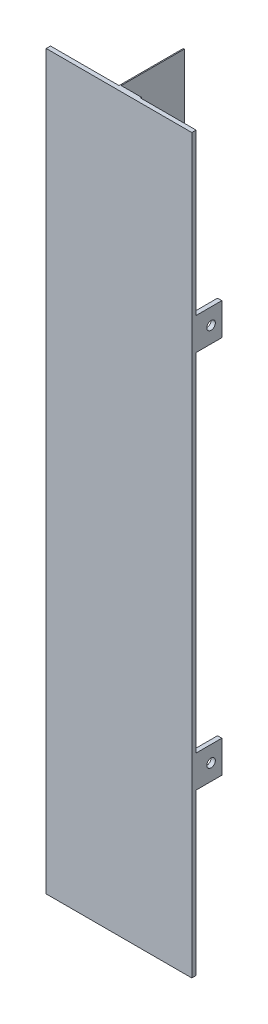
ISO-10303-21;
HEADER;
FILE_DESCRIPTION(('STEP AP214'),'2;1');
FILE_NAME('part.step','',(''),(''),'','','');
FILE_SCHEMA(('AUTOMOTIVE_DESIGN { 1 0 10303 214 1 1 1 1 }'));
ENDSEC;
DATA;
#1=APPLICATION_CONTEXT('core data for automotive mechanical design processes');
#2=APPLICATION_PROTOCOL_DEFINITION('international standard','automotive_design',2000,#1);
#3=PRODUCT_CONTEXT('',#1,'mechanical');
#4=PRODUCT('Part','Part','',(#3));
#5=PRODUCT_RELATED_PRODUCT_CATEGORY('part','',(#4));
#6=PRODUCT_DEFINITION_FORMATION('','',#4);
#7=PRODUCT_DEFINITION_CONTEXT('part definition',#1,'design');
#8=PRODUCT_DEFINITION('design','',#6,#7);
#9=PRODUCT_DEFINITION_SHAPE('','',#8);
#10=(LENGTH_UNIT() NAMED_UNIT(*) SI_UNIT(.MILLI.,.METRE.));
#11=(NAMED_UNIT(*) PLANE_ANGLE_UNIT() SI_UNIT($,.RADIAN.));
#12=(NAMED_UNIT(*) SI_UNIT($,.STERADIAN.) SOLID_ANGLE_UNIT());
#13=UNCERTAINTY_MEASURE_WITH_UNIT(LENGTH_MEASURE(1.E-05),#10,'distance_accuracy_value','');
#14=(GEOMETRIC_REPRESENTATION_CONTEXT(3) GLOBAL_UNCERTAINTY_ASSIGNED_CONTEXT((#13)) GLOBAL_UNIT_ASSIGNED_CONTEXT((#10,
#11,#12)) REPRESENTATION_CONTEXT('',''));
#15=CARTESIAN_POINT('',(0.,0.,0.));
#16=DIRECTION('',(0.,0.,1.));
#17=DIRECTION('',(1.,0.,0.));
#18=AXIS2_PLACEMENT_3D('',#15,#16,#17);
#19=CARTESIAN_POINT('',(0.,342.,-2.));
#20=DIRECTION('',(0.,0.,1.));
#21=DIRECTION('',(1.,0.,0.));
#22=AXIS2_PLACEMENT_3D('',#19,#20,#21);
#23=PLANE('',#22);
#24=DIRECTION('',(1.,0.,0.));
#25=VECTOR('',#24,1.);
#26=CARTESIAN_POINT('',(0.,267.,-2.));
#27=LINE('',#26,#25);
#28=CARTESIAN_POINT('',(0.,267.,-2.));
#29=VERTEX_POINT('',#28);
#30=CARTESIAN_POINT('',(2.,267.,-2.));
#31=VERTEX_POINT('',#30);
#32=EDGE_CURVE('E400',#29,#31,#27,.T.);
#33=ORIENTED_EDGE('',*,*,#32,.F.);
#34=DIRECTION('',(0.,-1.,0.));
#35=VECTOR('',#34,1.);
#36=CARTESIAN_POINT('',(0.,342.,-2.));
#37=LINE('',#36,#35);
#38=CARTESIAN_POINT('',(0.,342.,-2.));
#39=VERTEX_POINT('',#38);
#40=EDGE_CURVE('E232',#39,#29,#37,.T.);
#41=ORIENTED_EDGE('',*,*,#40,.F.);
#42=DIRECTION('',(-1.,0.,0.));
#43=VECTOR('',#42,1.);
#44=CARTESIAN_POINT('',(0.,342.,-2.));
#45=LINE('',#44,#43);
#46=CARTESIAN_POINT('',(32.,342.,-2.));
#47=VERTEX_POINT('',#46);
#48=EDGE_CURVE('E342',#47,#39,#45,.T.);
#49=ORIENTED_EDGE('',*,*,#48,.F.);
#50=DIRECTION('',(0.,-1.,0.));
#51=VECTOR('',#50,1.);
#52=CARTESIAN_POINT('',(32.,342.,-2.));
#53=LINE('',#52,#51);
#54=CARTESIAN_POINT('',(32.,0.,-2.));
#55=VERTEX_POINT('',#54);
#56=EDGE_CURVE('E372',#47,#55,#53,.T.);
#57=ORIENTED_EDGE('',*,*,#56,.T.);
#58=DIRECTION('',(-1.,0.,0.));
#59=VECTOR('',#58,1.);
#60=CARTESIAN_POINT('',(0.,0.,-2.));
#61=LINE('',#60,#59);
#62=CARTESIAN_POINT('',(0.,0.,-2.));
#63=VERTEX_POINT('',#62);
#64=EDGE_CURVE('E364',#55,#63,#61,.T.);
#65=ORIENTED_EDGE('',*,*,#64,.T.);
#66=CARTESIAN_POINT('',(0.,75.,-2.));
#67=VERTEX_POINT('',#66);
#68=EDGE_CURVE('E370',#67,#63,#37,.T.);
#69=ORIENTED_EDGE('',*,*,#68,.F.);
#70=DIRECTION('',(-1.,0.,0.));
#71=VECTOR('',#70,1.);
#72=CARTESIAN_POINT('',(0.,75.,-2.));
#73=LINE('',#72,#71);
#74=CARTESIAN_POINT('',(2.,75.,-2.));
#75=VERTEX_POINT('',#74);
#76=EDGE_CURVE('E245',#75,#67,#73,.T.);
#77=ORIENTED_EDGE('',*,*,#76,.F.);
#78=DIRECTION('',(0.,-1.,0.));
#79=VECTOR('',#78,1.);
#80=CARTESIAN_POINT('',(2.,75.,-2.));
#81=LINE('',#80,#79);
#82=CARTESIAN_POINT('',(2.,90.,-2.));
#83=VERTEX_POINT('',#82);
#84=EDGE_CURVE('E235',#83,#75,#81,.T.);
#85=ORIENTED_EDGE('',*,*,#84,.F.);
#86=DIRECTION('',(1.,0.,0.));
#87=VECTOR('',#86,1.);
#88=CARTESIAN_POINT('',(0.,90.,-2.));
#89=LINE('',#88,#87);
#90=CARTESIAN_POINT('',(0.,90.,-2.));
#91=VERTEX_POINT('',#90);
#92=EDGE_CURVE('E233',#91,#83,#89,.T.);
#93=ORIENTED_EDGE('',*,*,#92,.F.);
#94=CARTESIAN_POINT('',(0.,252.,-2.));
#95=VERTEX_POINT('',#94);
#96=EDGE_CURVE('E373',#95,#91,#37,.T.);
#97=ORIENTED_EDGE('',*,*,#96,.F.);
#98=DIRECTION('',(-1.,0.,0.));
#99=VECTOR('',#98,1.);
#100=CARTESIAN_POINT('',(0.,252.,-2.));
#101=LINE('',#100,#99);
#102=CARTESIAN_POINT('',(2.,252.,-2.));
#103=VERTEX_POINT('',#102);
#104=EDGE_CURVE('E226',#103,#95,#101,.T.);
#105=ORIENTED_EDGE('',*,*,#104,.F.);
#106=DIRECTION('',(0.,-1.,0.));
#107=VECTOR('',#106,1.);
#108=CARTESIAN_POINT('',(2.,252.,-2.));
#109=LINE('',#108,#107);
#110=EDGE_CURVE('E423',#31,#103,#109,.T.);
#111=ORIENTED_EDGE('',*,*,#110,.F.);
#112=EDGE_LOOP('',(#33,#41,#49,#57,#65,#69,#77,#85,#93,#97,#105,#111));
#113=FACE_BOUND('',#112,.T.);
#114=ADVANCED_FACE('F35',(#113),#23,.F.);
#115=CARTESIAN_POINT('',(42.,342.,-2.));
#116=DIRECTION('',(0.,0.,1.));
#117=DIRECTION('',(1.,0.,0.));
#118=AXIS2_PLACEMENT_3D('',#115,#116,#117);
#119=PLANE('',#118);
#120=DIRECTION('',(-1.,0.,0.));
#121=VECTOR('',#120,1.);
#122=CARTESIAN_POINT('',(68.,252.,-2.00000000000001));
#123=LINE('',#122,#121);
#124=CARTESIAN_POINT('',(68.,252.,-2.00000000000001));
#125=VERTEX_POINT('',#124);
#126=CARTESIAN_POINT('',(66.,252.,-2.));
#127=VERTEX_POINT('',#126);
#128=EDGE_CURVE('E263',#125,#127,#123,.T.);
#129=ORIENTED_EDGE('',*,*,#128,.F.);
#130=DIRECTION('',(0.,-1.,0.));
#131=VECTOR('',#130,1.);
#132=CARTESIAN_POINT('',(68.,342.,-2.));
#133=LINE('',#132,#131);
#134=CARTESIAN_POINT('',(68.,90.,-2.00000000000001));
#135=VERTEX_POINT('',#134);
#136=EDGE_CURVE('E392',#125,#135,#133,.T.);
#137=ORIENTED_EDGE('',*,*,#136,.T.);
#138=DIRECTION('',(1.,0.,0.));
#139=VECTOR('',#138,1.);
#140=CARTESIAN_POINT('',(68.,90.,-2.00000000000001));
#141=LINE('',#140,#139);
#142=CARTESIAN_POINT('',(66.,90.,-2.));
#143=VERTEX_POINT('',#142);
#144=EDGE_CURVE('E298',#143,#135,#141,.T.);
#145=ORIENTED_EDGE('',*,*,#144,.F.);
#146=DIRECTION('',(0.,1.,0.));
#147=VECTOR('',#146,1.);
#148=CARTESIAN_POINT('',(66.,75.,-2.00000000000001));
#149=LINE('',#148,#147);
#150=CARTESIAN_POINT('',(66.,75.,-2.));
#151=VERTEX_POINT('',#150);
#152=EDGE_CURVE('E307',#151,#143,#149,.T.);
#153=ORIENTED_EDGE('',*,*,#152,.F.);
#154=DIRECTION('',(-1.,0.,0.));
#155=VECTOR('',#154,1.);
#156=CARTESIAN_POINT('',(68.,75.,-2.00000000000001));
#157=LINE('',#156,#155);
#158=CARTESIAN_POINT('',(68.,75.,-2.));
#159=VERTEX_POINT('',#158);
#160=EDGE_CURVE('E293',#159,#151,#157,.T.);
#161=ORIENTED_EDGE('',*,*,#160,.F.);
#162=CARTESIAN_POINT('',(68.,0.,-2.));
#163=VERTEX_POINT('',#162);
#164=EDGE_CURVE('E391',#159,#163,#133,.T.);
#165=ORIENTED_EDGE('',*,*,#164,.T.);
#166=DIRECTION('',(-1.,0.,0.));
#167=VECTOR('',#166,1.);
#168=CARTESIAN_POINT('',(42.,0.,-2.));
#169=LINE('',#168,#167);
#170=CARTESIAN_POINT('',(42.,0.,-2.));
#171=VERTEX_POINT('',#170);
#172=EDGE_CURVE('E352',#163,#171,#169,.T.);
#173=ORIENTED_EDGE('',*,*,#172,.T.);
#174=DIRECTION('',(0.,-1.,0.));
#175=VECTOR('',#174,1.);
#176=CARTESIAN_POINT('',(42.,342.,-2.));
#177=LINE('',#176,#175);
#178=CARTESIAN_POINT('',(42.,342.,-2.));
#179=VERTEX_POINT('',#178);
#180=EDGE_CURVE('E388',#179,#171,#177,.T.);
#181=ORIENTED_EDGE('',*,*,#180,.F.);
#182=DIRECTION('',(-1.,0.,0.));
#183=VECTOR('',#182,1.);
#184=CARTESIAN_POINT('',(42.,342.,-2.));
#185=LINE('',#184,#183);
#186=CARTESIAN_POINT('',(68.,342.,-2.));
#187=VERTEX_POINT('',#186);
#188=EDGE_CURVE('E330',#187,#179,#185,.T.);
#189=ORIENTED_EDGE('',*,*,#188,.F.);
#190=CARTESIAN_POINT('',(68.,267.,-2.));
#191=VERTEX_POINT('',#190);
#192=EDGE_CURVE('E44',#187,#191,#133,.T.);
#193=ORIENTED_EDGE('',*,*,#192,.T.);
#194=DIRECTION('',(1.,0.,0.));
#195=VECTOR('',#194,1.);
#196=CARTESIAN_POINT('',(68.,267.,-2.00000000000001));
#197=LINE('',#196,#195);
#198=CARTESIAN_POINT('',(66.,267.,-2.));
#199=VERTEX_POINT('',#198);
#200=EDGE_CURVE('E268',#199,#191,#197,.T.);
#201=ORIENTED_EDGE('',*,*,#200,.F.);
#202=DIRECTION('',(0.,1.,0.));
#203=VECTOR('',#202,1.);
#204=CARTESIAN_POINT('',(66.,252.,-2.00000000000001));
#205=LINE('',#204,#203);
#206=EDGE_CURVE('E277',#127,#199,#205,.T.);
#207=ORIENTED_EDGE('',*,*,#206,.F.);
#208=EDGE_LOOP('',(#129,#137,#145,#153,#161,#165,#173,#181,#189,#193,#201,#207));
#209=FACE_BOUND('',#208,.T.);
#210=ADVANCED_FACE('F468',(#209),#119,.F.);
#211=CARTESIAN_POINT('',(68.,342.,0.));
#212=DIRECTION('',(0.,0.,-1.));
#213=DIRECTION('',(-1.,0.,0.));
#214=AXIS2_PLACEMENT_3D('',#211,#212,#213);
#215=PLANE('',#214);
#216=DIRECTION('',(1.,0.,0.));
#217=VECTOR('',#216,1.);
#218=CARTESIAN_POINT('',(68.,0.,0.));
#219=LINE('',#218,#217);
#220=CARTESIAN_POINT('',(0.,0.,0.));
#221=VERTEX_POINT('',#220);
#222=CARTESIAN_POINT('',(68.,0.,0.));
#223=VERTEX_POINT('',#222);
#224=EDGE_CURVE('E323',#221,#223,#219,.T.);
#225=ORIENTED_EDGE('',*,*,#224,.T.);
#226=DIRECTION('',(0.,-1.,0.));
#227=VECTOR('',#226,1.);
#228=CARTESIAN_POINT('',(68.,342.,0.));
#229=LINE('',#228,#227);
#230=CARTESIAN_POINT('',(68.,342.,0.));
#231=VERTEX_POINT('',#230);
#232=EDGE_CURVE('E11',#231,#223,#229,.T.);
#233=ORIENTED_EDGE('',*,*,#232,.F.);
#234=DIRECTION('',(1.,0.,0.));
#235=VECTOR('',#234,1.);
#236=CARTESIAN_POINT('',(68.,342.,0.));
#237=LINE('',#236,#235);
#238=CARTESIAN_POINT('',(0.,342.,0.));
#239=VERTEX_POINT('',#238);
#240=EDGE_CURVE('E324',#239,#231,#237,.T.);
#241=ORIENTED_EDGE('',*,*,#240,.F.);
#242=DIRECTION('',(0.,-1.,0.));
#243=VECTOR('',#242,1.);
#244=CARTESIAN_POINT('',(0.,342.,0.));
#245=LINE('',#244,#243);
#246=EDGE_CURVE('E346',#239,#221,#245,.T.);
#247=ORIENTED_EDGE('',*,*,#246,.T.);
#248=EDGE_LOOP('',(#225,#233,#241,#247));
#249=FACE_BOUND('',#248,.T.);
#250=ADVANCED_FACE('F37',(#249),#215,.F.);
#251=CARTESIAN_POINT('',(68.,342.,-2.));
#252=DIRECTION('',(-1.,0.,0.));
#253=DIRECTION('',(0.,0.,1.));
#254=AXIS2_PLACEMENT_3D('',#251,#252,#253);
#255=PLANE('',#254);
#256=CARTESIAN_POINT('',(68.,259.5,-9.));
#257=DIRECTION('',(1.,0.,0.));
#258=DIRECTION('',(0.,0.,-1.));
#259=AXIS2_PLACEMENT_3D('',#256,#257,#258);
#260=CIRCLE('',#259,2.);
#261=CARTESIAN_POINT('',(68.,259.5,-11.));
#262=VERTEX_POINT('',#261);
#263=EDGE_CURVE('E403',#262,#262,#260,.T.);
#264=ORIENTED_EDGE('',*,*,#263,.F.);
#265=EDGE_LOOP('',(#264));
#266=FACE_BOUND('',#265,.T.);
#267=CARTESIAN_POINT('',(68.,82.5,-9.));
#268=DIRECTION('',(1.,0.,0.));
#269=DIRECTION('',(0.,0.,-1.));
#270=AXIS2_PLACEMENT_3D('',#267,#268,#269);
#271=CIRCLE('',#270,2.);
#272=CARTESIAN_POINT('',(68.,82.5,-11.));
#273=VERTEX_POINT('',#272);
#274=EDGE_CURVE('E409',#273,#273,#271,.T.);
#275=ORIENTED_EDGE('',*,*,#274,.F.);
#276=EDGE_LOOP('',(#275));
#277=FACE_BOUND('',#276,.T.);
#278=DIRECTION('',(0.,0.,-1.));
#279=VECTOR('',#278,1.);
#280=CARTESIAN_POINT('',(68.,0.,-2.));
#281=LINE('',#280,#279);
#282=EDGE_CURVE('E349',#223,#163,#281,.T.);
#283=ORIENTED_EDGE('',*,*,#282,.T.);
#284=ORIENTED_EDGE('',*,*,#164,.F.);
#285=DIRECTION('',(0.,0.,1.));
#286=VECTOR('',#285,1.);
#287=CARTESIAN_POINT('',(68.,75.,-14.));
#288=LINE('',#287,#286);
#289=CARTESIAN_POINT('',(68.,75.,-14.));
#290=VERTEX_POINT('',#289);
#291=EDGE_CURVE('E320',#290,#159,#288,.T.);
#292=ORIENTED_EDGE('',*,*,#291,.F.);
#293=DIRECTION('',(0.,-1.,0.));
#294=VECTOR('',#293,1.);
#295=CARTESIAN_POINT('',(68.,75.,-14.));
#296=LINE('',#295,#294);
#297=CARTESIAN_POINT('',(68.,90.,-14.));
#298=VERTEX_POINT('',#297);
#299=EDGE_CURVE('E294',#298,#290,#296,.T.);
#300=ORIENTED_EDGE('',*,*,#299,.F.);
#301=DIRECTION('',(0.,0.,1.));
#302=VECTOR('',#301,1.);
#303=CARTESIAN_POINT('',(68.,90.,-14.));
#304=LINE('',#303,#302);
#305=EDGE_CURVE('E304',#298,#135,#304,.T.);
#306=ORIENTED_EDGE('',*,*,#305,.T.);
#307=ORIENTED_EDGE('',*,*,#136,.F.);
#308=DIRECTION('',(0.,0.,1.));
#309=VECTOR('',#308,1.);
#310=CARTESIAN_POINT('',(68.,252.,-14.));
#311=LINE('',#310,#309);
#312=CARTESIAN_POINT('',(68.,252.,-14.));
#313=VERTEX_POINT('',#312);
#314=EDGE_CURVE('E290',#313,#125,#311,.T.);
#315=ORIENTED_EDGE('',*,*,#314,.F.);
#316=DIRECTION('',(0.,-1.,0.));
#317=VECTOR('',#316,1.);
#318=CARTESIAN_POINT('',(68.,252.,-14.));
#319=LINE('',#318,#317);
#320=CARTESIAN_POINT('',(68.,267.,-14.));
#321=VERTEX_POINT('',#320);
#322=EDGE_CURVE('E264',#321,#313,#319,.T.);
#323=ORIENTED_EDGE('',*,*,#322,.F.);
#324=DIRECTION('',(0.,0.,1.));
#325=VECTOR('',#324,1.);
#326=CARTESIAN_POINT('',(68.,267.,-14.));
#327=LINE('',#326,#325);
#328=EDGE_CURVE('E274',#321,#191,#327,.T.);
#329=ORIENTED_EDGE('',*,*,#328,.T.);
#330=ORIENTED_EDGE('',*,*,#192,.F.);
#331=DIRECTION('',(0.,0.,-1.));
#332=VECTOR('',#331,1.);
#333=CARTESIAN_POINT('',(68.,342.,-2.));
#334=LINE('',#333,#332);
#335=EDGE_CURVE('E327',#231,#187,#334,.T.);
#336=ORIENTED_EDGE('',*,*,#335,.F.);
#337=ORIENTED_EDGE('',*,*,#232,.T.);
#338=EDGE_LOOP('',(#283,#284,#292,#300,#306,#307,#315,#323,#329,#330,#336,#337));
#339=FACE_BOUND('',#338,.T.);
#340=ADVANCED_FACE('F496',(#266,#277,#339),#255,.F.);
#341=CARTESIAN_POINT('',(42.,342.,-2.5));
#342=DIRECTION('',(-1.,0.,0.));
#343=DIRECTION('',(0.,0.,1.));
#344=AXIS2_PLACEMENT_3D('',#341,#342,#343);
#345=PLANE('',#344);
#346=DIRECTION('',(0.,0.,-1.));
#347=VECTOR('',#346,1.);
#348=CARTESIAN_POINT('',(42.,0.,-2.5));
#349=LINE('',#348,#347);
#350=CARTESIAN_POINT('',(42.,0.,-2.5));
#351=VERTEX_POINT('',#350);
#352=EDGE_CURVE('E354',#171,#351,#349,.T.);
#353=ORIENTED_EDGE('',*,*,#352,.T.);
#354=DIRECTION('',(0.,-1.,0.));
#355=VECTOR('',#354,1.);
#356=CARTESIAN_POINT('',(42.,342.,-2.5));
#357=LINE('',#356,#355);
#358=CARTESIAN_POINT('',(42.,342.,-2.5));
#359=VERTEX_POINT('',#358);
#360=EDGE_CURVE('E385',#359,#351,#357,.T.);
#361=ORIENTED_EDGE('',*,*,#360,.F.);
#362=DIRECTION('',(0.,0.,-1.));
#363=VECTOR('',#362,1.);
#364=CARTESIAN_POINT('',(42.,342.,-2.5));
#365=LINE('',#364,#363);
#366=EDGE_CURVE('E332',#179,#359,#365,.T.);
#367=ORIENTED_EDGE('',*,*,#366,.F.);
#368=ORIENTED_EDGE('',*,*,#180,.T.);
#369=EDGE_LOOP('',(#353,#361,#367,#368));
#370=FACE_BOUND('',#369,.T.);
#371=ADVANCED_FACE('F493',(#370),#345,.F.);
#372=CARTESIAN_POINT('',(32.5,342.,-2.5));
#373=DIRECTION('',(0.,0.,1.));
#374=DIRECTION('',(1.,0.,0.));
#375=AXIS2_PLACEMENT_3D('',#372,#373,#374);
#376=PLANE('',#375);
#377=DIRECTION('',(-1.,0.,0.));
#378=VECTOR('',#377,1.);
#379=CARTESIAN_POINT('',(32.5,0.,-2.5));
#380=LINE('',#379,#378);
#381=CARTESIAN_POINT('',(32.5,0.,-2.5));
#382=VERTEX_POINT('',#381);
#383=EDGE_CURVE('E356',#351,#382,#380,.T.);
#384=ORIENTED_EDGE('',*,*,#383,.T.);
#385=DIRECTION('',(0.,-1.,0.));
#386=VECTOR('',#385,1.);
#387=CARTESIAN_POINT('',(32.5,342.,-2.5));
#388=LINE('',#387,#386);
#389=CARTESIAN_POINT('',(32.5,342.,-2.5));
#390=VERTEX_POINT('',#389);
#391=EDGE_CURVE('E382',#390,#382,#388,.T.);
#392=ORIENTED_EDGE('',*,*,#391,.F.);
#393=DIRECTION('',(-1.,0.,0.));
#394=VECTOR('',#393,1.);
#395=CARTESIAN_POINT('',(32.5,342.,-2.5));
#396=LINE('',#395,#394);
#397=EDGE_CURVE('E334',#359,#390,#396,.T.);
#398=ORIENTED_EDGE('',*,*,#397,.F.);
#399=ORIENTED_EDGE('',*,*,#360,.T.);
#400=EDGE_LOOP('',(#384,#392,#398,#399));
#401=FACE_BOUND('',#400,.T.);
#402=ADVANCED_FACE('F489',(#401),#376,.F.);
#403=CARTESIAN_POINT('',(32.5,342.,-32.));
#404=DIRECTION('',(-1.,0.,0.));
#405=DIRECTION('',(0.,0.,1.));
#406=AXIS2_PLACEMENT_3D('',#403,#404,#405);
#407=PLANE('',#406);
#408=DIRECTION('',(0.,0.,-1.));
#409=VECTOR('',#408,1.);
#410=CARTESIAN_POINT('',(32.5,0.,-32.));
#411=LINE('',#410,#409);
#412=CARTESIAN_POINT('',(32.5,0.,-32.));
#413=VERTEX_POINT('',#412);
#414=EDGE_CURVE('E358',#382,#413,#411,.T.);
#415=ORIENTED_EDGE('',*,*,#414,.T.);
#416=DIRECTION('',(0.,-1.,0.));
#417=VECTOR('',#416,1.);
#418=CARTESIAN_POINT('',(32.5,342.,-32.));
#419=LINE('',#418,#417);
#420=CARTESIAN_POINT('',(32.5,342.,-32.));
#421=VERTEX_POINT('',#420);
#422=EDGE_CURVE('E379',#421,#413,#419,.T.);
#423=ORIENTED_EDGE('',*,*,#422,.F.);
#424=DIRECTION('',(0.,0.,-1.));
#425=VECTOR('',#424,1.);
#426=CARTESIAN_POINT('',(32.5,342.,-32.));
#427=LINE('',#426,#425);
#428=EDGE_CURVE('E336',#390,#421,#427,.T.);
#429=ORIENTED_EDGE('',*,*,#428,.F.);
#430=ORIENTED_EDGE('',*,*,#391,.T.);
#431=EDGE_LOOP('',(#415,#423,#429,#430));
#432=FACE_BOUND('',#431,.T.);
#433=ADVANCED_FACE('F485',(#432),#407,.F.);
#434=CARTESIAN_POINT('',(32.,342.,-32.));
#435=DIRECTION('',(0.,0.,1.));
#436=DIRECTION('',(1.,0.,0.));
#437=AXIS2_PLACEMENT_3D('',#434,#435,#436);
#438=PLANE('',#437);
#439=DIRECTION('',(-1.,0.,0.));
#440=VECTOR('',#439,1.);
#441=CARTESIAN_POINT('',(32.,0.,-32.));
#442=LINE('',#441,#440);
#443=CARTESIAN_POINT('',(32.,0.,-32.));
#444=VERTEX_POINT('',#443);
#445=EDGE_CURVE('E360',#413,#444,#442,.T.);
#446=ORIENTED_EDGE('',*,*,#445,.T.);
#447=DIRECTION('',(0.,-1.,0.));
#448=VECTOR('',#447,1.);
#449=CARTESIAN_POINT('',(32.,342.,-32.));
#450=LINE('',#449,#448);
#451=CARTESIAN_POINT('',(32.,342.,-32.));
#452=VERTEX_POINT('',#451);
#453=EDGE_CURVE('E376',#452,#444,#450,.T.);
#454=ORIENTED_EDGE('',*,*,#453,.F.);
#455=DIRECTION('',(-1.,0.,0.));
#456=VECTOR('',#455,1.);
#457=CARTESIAN_POINT('',(32.,342.,-32.));
#458=LINE('',#457,#456);
#459=EDGE_CURVE('E338',#421,#452,#458,.T.);
#460=ORIENTED_EDGE('',*,*,#459,.F.);
#461=ORIENTED_EDGE('',*,*,#422,.T.);
#462=EDGE_LOOP('',(#446,#454,#460,#461));
#463=FACE_BOUND('',#462,.T.);
#464=ADVANCED_FACE('F481',(#463),#438,.F.);
#465=CARTESIAN_POINT('',(32.,342.,-2.));
#466=DIRECTION('',(1.,0.,0.));
#467=DIRECTION('',(0.,0.,-1.));
#468=AXIS2_PLACEMENT_3D('',#465,#466,#467);
#469=PLANE('',#468);
#470=DIRECTION('',(0.,0.,1.));
#471=VECTOR('',#470,1.);
#472=CARTESIAN_POINT('',(32.,0.,-2.));
#473=LINE('',#472,#471);
#474=EDGE_CURVE('E362',#444,#55,#473,.T.);
#475=ORIENTED_EDGE('',*,*,#474,.T.);
#476=ORIENTED_EDGE('',*,*,#56,.F.);
#477=DIRECTION('',(0.,0.,1.));
#478=VECTOR('',#477,1.);
#479=CARTESIAN_POINT('',(32.,342.,-2.));
#480=LINE('',#479,#478);
#481=EDGE_CURVE('E340',#452,#47,#480,.T.);
#482=ORIENTED_EDGE('',*,*,#481,.F.);
#483=ORIENTED_EDGE('',*,*,#453,.T.);
#484=EDGE_LOOP('',(#475,#476,#482,#483));
#485=FACE_BOUND('',#484,.T.);
#486=ADVANCED_FACE('F478',(#485),#469,.F.);
#487=CARTESIAN_POINT('',(0.,342.,0.));
#488=DIRECTION('',(1.,0.,0.));
#489=DIRECTION('',(0.,0.,-1.));
#490=AXIS2_PLACEMENT_3D('',#487,#488,#489);
#491=PLANE('',#490);
#492=CARTESIAN_POINT('',(0.,82.5,-9.));
#493=DIRECTION('',(-1.,0.,0.));
#494=DIRECTION('',(0.,0.,1.));
#495=AXIS2_PLACEMENT_3D('',#492,#493,#494);
#496=CIRCLE('',#495,2.);
#497=CARTESIAN_POINT('',(0.,82.5,-7.));
#498=VERTEX_POINT('',#497);
#499=EDGE_CURVE('E398',#498,#498,#496,.T.);
#500=ORIENTED_EDGE('',*,*,#499,.F.);
#501=EDGE_LOOP('',(#500));
#502=FACE_BOUND('',#501,.T.);
#503=CARTESIAN_POINT('',(0.,259.5,-9.));
#504=DIRECTION('',(-1.,0.,0.));
#505=DIRECTION('',(0.,0.,1.));
#506=AXIS2_PLACEMENT_3D('',#503,#504,#505);
#507=CIRCLE('',#506,2.);
#508=CARTESIAN_POINT('',(0.,259.5,-7.));
#509=VERTEX_POINT('',#508);
#510=EDGE_CURVE('E407',#509,#509,#507,.T.);
#511=ORIENTED_EDGE('',*,*,#510,.F.);
#512=EDGE_LOOP('',(#511));
#513=FACE_BOUND('',#512,.T.);
#514=DIRECTION('',(0.,0.,1.));
#515=VECTOR('',#514,1.);
#516=CARTESIAN_POINT('',(0.,0.,0.));
#517=LINE('',#516,#515);
#518=EDGE_CURVE('E328',#63,#221,#517,.T.);
#519=ORIENTED_EDGE('',*,*,#518,.T.);
#520=ORIENTED_EDGE('',*,*,#246,.F.);
#521=DIRECTION('',(0.,0.,1.));
#522=VECTOR('',#521,1.);
#523=CARTESIAN_POINT('',(0.,342.,0.));
#524=LINE('',#523,#522);
#525=EDGE_CURVE('E344',#39,#239,#524,.T.);
#526=ORIENTED_EDGE('',*,*,#525,.F.);
#527=ORIENTED_EDGE('',*,*,#40,.T.);
#528=DIRECTION('',(0.,0.,1.));
#529=VECTOR('',#528,1.);
#530=CARTESIAN_POINT('',(0.,267.,-14.));
#531=LINE('',#530,#529);
#532=CARTESIAN_POINT('',(0.,267.,-14.));
#533=VERTEX_POINT('',#532);
#534=EDGE_CURVE('E214',#533,#29,#531,.T.);
#535=ORIENTED_EDGE('',*,*,#534,.F.);
#536=DIRECTION('',(0.,1.,0.));
#537=VECTOR('',#536,1.);
#538=CARTESIAN_POINT('',(0.,252.,-14.));
#539=LINE('',#538,#537);
#540=CARTESIAN_POINT('',(0.,252.,-14.));
#541=VERTEX_POINT('',#540);
#542=EDGE_CURVE('E221',#541,#533,#539,.T.);
#543=ORIENTED_EDGE('',*,*,#542,.F.);
#544=DIRECTION('',(0.,0.,1.));
#545=VECTOR('',#544,1.);
#546=CARTESIAN_POINT('',(0.,252.,-14.));
#547=LINE('',#546,#545);
#548=EDGE_CURVE('E52',#541,#95,#547,.T.);
#549=ORIENTED_EDGE('',*,*,#548,.T.);
#550=ORIENTED_EDGE('',*,*,#96,.T.);
#551=DIRECTION('',(0.,0.,1.));
#552=VECTOR('',#551,1.);
#553=CARTESIAN_POINT('',(0.,90.,-14.));
#554=LINE('',#553,#552);
#555=CARTESIAN_POINT('',(0.,90.,-14.));
#556=VERTEX_POINT('',#555);
#557=EDGE_CURVE('E260',#556,#91,#554,.T.);
#558=ORIENTED_EDGE('',*,*,#557,.F.);
#559=DIRECTION('',(0.,1.,0.));
#560=VECTOR('',#559,1.);
#561=CARTESIAN_POINT('',(0.,75.,-14.));
#562=LINE('',#561,#560);
#563=CARTESIAN_POINT('',(0.,75.,-14.));
#564=VERTEX_POINT('',#563);
#565=EDGE_CURVE('E241',#564,#556,#562,.T.);
#566=ORIENTED_EDGE('',*,*,#565,.F.);
#567=DIRECTION('',(0.,0.,1.));
#568=VECTOR('',#567,1.);
#569=CARTESIAN_POINT('',(0.,75.,-14.));
#570=LINE('',#569,#568);
#571=EDGE_CURVE('E59',#564,#67,#570,.T.);
#572=ORIENTED_EDGE('',*,*,#571,.T.);
#573=ORIENTED_EDGE('',*,*,#68,.T.);
#574=EDGE_LOOP('',(#519,#520,#526,#527,#535,#543,#549,#550,#558,#566,#572,#573));
#575=FACE_BOUND('',#574,.T.);
#576=ADVANCED_FACE('F229',(#502,#513,#575),#491,.F.);
#577=CARTESIAN_POINT('',(0.,342.,0.));
#578=DIRECTION('',(0.,-1.,0.));
#579=DIRECTION('',(0.,0.,-1.));
#580=AXIS2_PLACEMENT_3D('',#577,#578,#579);
#581=PLANE('',#580);
#582=ORIENTED_EDGE('',*,*,#240,.T.);
#583=ORIENTED_EDGE('',*,*,#335,.T.);
#584=ORIENTED_EDGE('',*,*,#188,.T.);
#585=ORIENTED_EDGE('',*,*,#366,.T.);
#586=ORIENTED_EDGE('',*,*,#397,.T.);
#587=ORIENTED_EDGE('',*,*,#428,.T.);
#588=ORIENTED_EDGE('',*,*,#459,.T.);
#589=ORIENTED_EDGE('',*,*,#481,.T.);
#590=ORIENTED_EDGE('',*,*,#48,.T.);
#591=ORIENTED_EDGE('',*,*,#525,.T.);
#592=EDGE_LOOP('',(#582,#583,#584,#585,#586,#587,#588,#589,#590,#591));
#593=FACE_BOUND('',#592,.T.);
#594=ADVANCED_FACE('F454',(#593),#581,.F.);
#595=CARTESIAN_POINT('',(0.,0.,0.));
#596=DIRECTION('',(0.,-1.,0.));
#597=DIRECTION('',(0.,0.,-1.));
#598=AXIS2_PLACEMENT_3D('',#595,#596,#597);
#599=PLANE('',#598);
#600=ORIENTED_EDGE('',*,*,#224,.F.);
#601=ORIENTED_EDGE('',*,*,#518,.F.);
#602=ORIENTED_EDGE('',*,*,#64,.F.);
#603=ORIENTED_EDGE('',*,*,#474,.F.);
#604=ORIENTED_EDGE('',*,*,#445,.F.);
#605=ORIENTED_EDGE('',*,*,#414,.F.);
#606=ORIENTED_EDGE('',*,*,#383,.F.);
#607=ORIENTED_EDGE('',*,*,#352,.F.);
#608=ORIENTED_EDGE('',*,*,#172,.F.);
#609=ORIENTED_EDGE('',*,*,#282,.F.);
#610=EDGE_LOOP('',(#600,#601,#602,#603,#604,#605,#606,#607,#608,#609));
#611=FACE_BOUND('',#610,.T.);
#612=ADVANCED_FACE('F448',(#611),#599,.T.);
#613=CARTESIAN_POINT('',(68.,75.,-14.));
#614=DIRECTION('',(0.,1.,0.));
#615=DIRECTION('',(-1.,0.,0.));
#616=AXIS2_PLACEMENT_3D('',#613,#614,#615);
#617=PLANE('',#616);
#618=ORIENTED_EDGE('',*,*,#160,.T.);
#619=DIRECTION('',(0.,0.,1.));
#620=VECTOR('',#619,1.);
#621=CARTESIAN_POINT('',(66.,75.,-14.));
#622=LINE('',#621,#620);
#623=CARTESIAN_POINT('',(66.,75.,-14.));
#624=VERTEX_POINT('',#623);
#625=EDGE_CURVE('E317',#624,#151,#622,.T.);
#626=ORIENTED_EDGE('',*,*,#625,.F.);
#627=DIRECTION('',(-1.,0.,0.));
#628=VECTOR('',#627,1.);
#629=CARTESIAN_POINT('',(68.,75.,-14.));
#630=LINE('',#629,#628);
#631=EDGE_CURVE('E297',#290,#624,#630,.T.);
#632=ORIENTED_EDGE('',*,*,#631,.F.);
#633=ORIENTED_EDGE('',*,*,#291,.T.);
#634=EDGE_LOOP('',(#618,#626,#632,#633));
#635=FACE_BOUND('',#634,.T.);
#636=ADVANCED_FACE('F552',(#635),#617,.F.);
#637=CARTESIAN_POINT('',(66.,75.,-14.));
#638=DIRECTION('',(1.,0.,0.));
#639=DIRECTION('',(0.,0.,-1.));
#640=AXIS2_PLACEMENT_3D('',#637,#638,#639);
#641=PLANE('',#640);
#642=CARTESIAN_POINT('',(66.,82.5,-9.));
#643=DIRECTION('',(1.,0.,0.));
#644=DIRECTION('',(0.,0.,-1.));
#645=AXIS2_PLACEMENT_3D('',#642,#643,#644);
#646=CIRCLE('',#645,2.);
#647=CARTESIAN_POINT('',(66.,82.5,-11.));
#648=VERTEX_POINT('',#647);
#649=EDGE_CURVE('E39',#648,#648,#646,.T.);
#650=ORIENTED_EDGE('',*,*,#649,.T.);
#651=EDGE_LOOP('',(#650));
#652=FACE_BOUND('',#651,.T.);
#653=ORIENTED_EDGE('',*,*,#152,.T.);
#654=DIRECTION('',(0.,0.,1.));
#655=VECTOR('',#654,1.);
#656=CARTESIAN_POINT('',(66.,90.,-14.));
#657=LINE('',#656,#655);
#658=CARTESIAN_POINT('',(66.,90.,-14.));
#659=VERTEX_POINT('',#658);
#660=EDGE_CURVE('E314',#659,#143,#657,.T.);
#661=ORIENTED_EDGE('',*,*,#660,.F.);
#662=DIRECTION('',(0.,1.,0.));
#663=VECTOR('',#662,1.);
#664=CARTESIAN_POINT('',(66.,75.,-14.));
#665=LINE('',#664,#663);
#666=EDGE_CURVE('E300',#624,#659,#665,.T.);
#667=ORIENTED_EDGE('',*,*,#666,.F.);
#668=ORIENTED_EDGE('',*,*,#625,.T.);
#669=EDGE_LOOP('',(#653,#661,#667,#668));
#670=FACE_BOUND('',#669,.T.);
#671=ADVANCED_FACE('F548',(#652,#670),#641,.F.);
#672=CARTESIAN_POINT('',(68.,90.,-14.));
#673=DIRECTION('',(0.,-1.,0.));
#674=DIRECTION('',(0.,0.,-1.));
#675=AXIS2_PLACEMENT_3D('',#672,#673,#674);
#676=PLANE('',#675);
#677=ORIENTED_EDGE('',*,*,#144,.T.);
#678=ORIENTED_EDGE('',*,*,#305,.F.);
#679=DIRECTION('',(1.,0.,0.));
#680=VECTOR('',#679,1.);
#681=CARTESIAN_POINT('',(68.,90.,-14.));
#682=LINE('',#681,#680);
#683=EDGE_CURVE('E302',#659,#298,#682,.T.);
#684=ORIENTED_EDGE('',*,*,#683,.F.);
#685=ORIENTED_EDGE('',*,*,#660,.T.);
#686=EDGE_LOOP('',(#677,#678,#684,#685));
#687=FACE_BOUND('',#686,.T.);
#688=ADVANCED_FACE('F541',(#687),#676,.F.);
#689=CARTESIAN_POINT('',(0.,0.,-14.));
#690=DIRECTION('',(0.,0.,1.));
#691=DIRECTION('',(1.,0.,0.));
#692=AXIS2_PLACEMENT_3D('',#689,#690,#691);
#693=PLANE('',#692);
#694=ORIENTED_EDGE('',*,*,#299,.T.);
#695=ORIENTED_EDGE('',*,*,#631,.T.);
#696=ORIENTED_EDGE('',*,*,#666,.T.);
#697=ORIENTED_EDGE('',*,*,#683,.T.);
#698=EDGE_LOOP('',(#694,#695,#696,#697));
#699=FACE_BOUND('',#698,.T.);
#700=ADVANCED_FACE('F534',(#699),#693,.F.);
#701=CARTESIAN_POINT('',(68.,252.,-14.));
#702=DIRECTION('',(0.,1.,0.));
#703=DIRECTION('',(0.,0.,1.));
#704=AXIS2_PLACEMENT_3D('',#701,#702,#703);
#705=PLANE('',#704);
#706=ORIENTED_EDGE('',*,*,#128,.T.);
#707=DIRECTION('',(0.,0.,1.));
#708=VECTOR('',#707,1.);
#709=CARTESIAN_POINT('',(66.,252.,-14.));
#710=LINE('',#709,#708);
#711=CARTESIAN_POINT('',(66.,252.,-14.));
#712=VERTEX_POINT('',#711);
#713=EDGE_CURVE('E287',#712,#127,#710,.T.);
#714=ORIENTED_EDGE('',*,*,#713,.F.);
#715=DIRECTION('',(-1.,0.,0.));
#716=VECTOR('',#715,1.);
#717=CARTESIAN_POINT('',(68.,252.,-14.));
#718=LINE('',#717,#716);
#719=EDGE_CURVE('E267',#313,#712,#718,.T.);
#720=ORIENTED_EDGE('',*,*,#719,.F.);
#721=ORIENTED_EDGE('',*,*,#314,.T.);
#722=EDGE_LOOP('',(#706,#714,#720,#721));
#723=FACE_BOUND('',#722,.T.);
#724=ADVANCED_FACE('F532',(#723),#705,.F.);
#725=CARTESIAN_POINT('',(66.,252.,-14.));
#726=DIRECTION('',(1.,0.,0.));
#727=DIRECTION('',(0.,0.,-1.));
#728=AXIS2_PLACEMENT_3D('',#725,#726,#727);
#729=PLANE('',#728);
#730=CARTESIAN_POINT('',(66.,259.5,-9.));
#731=DIRECTION('',(1.,0.,0.));
#732=DIRECTION('',(0.,0.,-1.));
#733=AXIS2_PLACEMENT_3D('',#730,#731,#732);
#734=CIRCLE('',#733,2.);
#735=CARTESIAN_POINT('',(66.,259.5,-11.));
#736=VERTEX_POINT('',#735);
#737=EDGE_CURVE('E401',#736,#736,#734,.T.);
#738=ORIENTED_EDGE('',*,*,#737,.T.);
#739=EDGE_LOOP('',(#738));
#740=FACE_BOUND('',#739,.T.);
#741=ORIENTED_EDGE('',*,*,#206,.T.);
#742=DIRECTION('',(0.,0.,1.));
#743=VECTOR('',#742,1.);
#744=CARTESIAN_POINT('',(66.,267.,-14.));
#745=LINE('',#744,#743);
#746=CARTESIAN_POINT('',(66.,267.,-14.));
#747=VERTEX_POINT('',#746);
#748=EDGE_CURVE('E284',#747,#199,#745,.T.);
#749=ORIENTED_EDGE('',*,*,#748,.F.);
#750=DIRECTION('',(0.,1.,0.));
#751=VECTOR('',#750,1.);
#752=CARTESIAN_POINT('',(66.,252.,-14.));
#753=LINE('',#752,#751);
#754=EDGE_CURVE('E270',#712,#747,#753,.T.);
#755=ORIENTED_EDGE('',*,*,#754,.F.);
#756=ORIENTED_EDGE('',*,*,#713,.T.);
#757=EDGE_LOOP('',(#741,#749,#755,#756));
#758=FACE_BOUND('',#757,.T.);
#759=ADVANCED_FACE('F530',(#740,#758),#729,.F.);
#760=CARTESIAN_POINT('',(68.,267.,-14.));
#761=DIRECTION('',(0.,-1.,0.));
#762=DIRECTION('',(0.,0.,-1.));
#763=AXIS2_PLACEMENT_3D('',#760,#761,#762);
#764=PLANE('',#763);
#765=ORIENTED_EDGE('',*,*,#200,.T.);
#766=ORIENTED_EDGE('',*,*,#328,.F.);
#767=DIRECTION('',(1.,0.,0.));
#768=VECTOR('',#767,1.);
#769=CARTESIAN_POINT('',(68.,267.,-14.));
#770=LINE('',#769,#768);
#771=EDGE_CURVE('E272',#747,#321,#770,.T.);
#772=ORIENTED_EDGE('',*,*,#771,.F.);
#773=ORIENTED_EDGE('',*,*,#748,.T.);
#774=EDGE_LOOP('',(#765,#766,#772,#773));
#775=FACE_BOUND('',#774,.T.);
#776=ADVANCED_FACE('F520',(#775),#764,.F.);
#777=CARTESIAN_POINT('',(0.,0.,-14.));
#778=DIRECTION('',(0.,0.,1.));
#779=DIRECTION('',(1.,0.,0.));
#780=AXIS2_PLACEMENT_3D('',#777,#778,#779);
#781=PLANE('',#780);
#782=ORIENTED_EDGE('',*,*,#322,.T.);
#783=ORIENTED_EDGE('',*,*,#719,.T.);
#784=ORIENTED_EDGE('',*,*,#754,.T.);
#785=ORIENTED_EDGE('',*,*,#771,.T.);
#786=EDGE_LOOP('',(#782,#783,#784,#785));
#787=FACE_BOUND('',#786,.T.);
#788=ADVANCED_FACE('F526',(#787),#781,.F.);
#789=CARTESIAN_POINT('',(0.,90.,-14.));
#790=DIRECTION('',(0.,-1.,0.));
#791=DIRECTION('',(0.,0.,-1.));
#792=AXIS2_PLACEMENT_3D('',#789,#790,#791);
#793=PLANE('',#792);
#794=ORIENTED_EDGE('',*,*,#92,.T.);
#795=DIRECTION('',(0.,0.,1.));
#796=VECTOR('',#795,1.);
#797=CARTESIAN_POINT('',(2.,90.,-14.));
#798=LINE('',#797,#796);
#799=CARTESIAN_POINT('',(2.,90.,-14.));
#800=VERTEX_POINT('',#799);
#801=EDGE_CURVE('E257',#800,#83,#798,.T.);
#802=ORIENTED_EDGE('',*,*,#801,.F.);
#803=DIRECTION('',(1.,0.,0.));
#804=VECTOR('',#803,1.);
#805=CARTESIAN_POINT('',(0.,90.,-14.));
#806=LINE('',#805,#804);
#807=EDGE_CURVE('E244',#556,#800,#806,.T.);
#808=ORIENTED_EDGE('',*,*,#807,.F.);
#809=ORIENTED_EDGE('',*,*,#557,.T.);
#810=EDGE_LOOP('',(#794,#802,#808,#809));
#811=FACE_BOUND('',#810,.T.);
#812=ADVANCED_FACE('F603',(#811),#793,.F.);
#813=CARTESIAN_POINT('',(2.,75.,-14.));
#814=DIRECTION('',(-1.,0.,0.));
#815=DIRECTION('',(0.,0.,1.));
#816=AXIS2_PLACEMENT_3D('',#813,#814,#815);
#817=PLANE('',#816);
#818=CARTESIAN_POINT('',(2.,82.5,-9.));
#819=DIRECTION('',(-1.,0.,0.));
#820=DIRECTION('',(0.,0.,1.));
#821=AXIS2_PLACEMENT_3D('',#818,#819,#820);
#822=CIRCLE('',#821,2.);
#823=CARTESIAN_POINT('',(2.,82.5,-7.));
#824=VERTEX_POINT('',#823);
#825=EDGE_CURVE('E397',#824,#824,#822,.T.);
#826=ORIENTED_EDGE('',*,*,#825,.T.);
#827=EDGE_LOOP('',(#826));
#828=FACE_BOUND('',#827,.T.);
#829=ORIENTED_EDGE('',*,*,#84,.T.);
#830=DIRECTION('',(0.,0.,1.));
#831=VECTOR('',#830,1.);
#832=CARTESIAN_POINT('',(2.,75.,-14.));
#833=LINE('',#832,#831);
#834=CARTESIAN_POINT('',(2.,75.,-14.));
#835=VERTEX_POINT('',#834);
#836=EDGE_CURVE('E254',#835,#75,#833,.T.);
#837=ORIENTED_EDGE('',*,*,#836,.F.);
#838=DIRECTION('',(0.,-1.,0.));
#839=VECTOR('',#838,1.);
#840=CARTESIAN_POINT('',(2.,75.,-14.));
#841=LINE('',#840,#839);
#842=EDGE_CURVE('E247',#800,#835,#841,.T.);
#843=ORIENTED_EDGE('',*,*,#842,.F.);
#844=ORIENTED_EDGE('',*,*,#801,.T.);
#845=EDGE_LOOP('',(#829,#837,#843,#844));
#846=FACE_BOUND('',#845,.T.);
#847=ADVANCED_FACE('F612',(#828,#846),#817,.F.);
#848=CARTESIAN_POINT('',(0.,75.,-14.));
#849=DIRECTION('',(0.,1.,0.));
#850=DIRECTION('',(0.,0.,1.));
#851=AXIS2_PLACEMENT_3D('',#848,#849,#850);
#852=PLANE('',#851);
#853=ORIENTED_EDGE('',*,*,#76,.T.);
#854=ORIENTED_EDGE('',*,*,#571,.F.);
#855=DIRECTION('',(-1.,0.,0.));
#856=VECTOR('',#855,1.);
#857=CARTESIAN_POINT('',(0.,75.,-14.));
#858=LINE('',#857,#856);
#859=EDGE_CURVE('E249',#835,#564,#858,.T.);
#860=ORIENTED_EDGE('',*,*,#859,.F.);
#861=ORIENTED_EDGE('',*,*,#836,.T.);
#862=EDGE_LOOP('',(#853,#854,#860,#861));
#863=FACE_BOUND('',#862,.T.);
#864=ADVANCED_FACE('F620',(#863),#852,.F.);
#865=CARTESIAN_POINT('',(0.,0.,-14.));
#866=DIRECTION('',(0.,0.,-1.));
#867=DIRECTION('',(-1.,0.,0.));
#868=AXIS2_PLACEMENT_3D('',#865,#866,#867);
#869=PLANE('',#868);
#870=ORIENTED_EDGE('',*,*,#565,.T.);
#871=ORIENTED_EDGE('',*,*,#807,.T.);
#872=ORIENTED_EDGE('',*,*,#842,.T.);
#873=ORIENTED_EDGE('',*,*,#859,.T.);
#874=EDGE_LOOP('',(#870,#871,#872,#873));
#875=FACE_BOUND('',#874,.T.);
#876=ADVANCED_FACE('F465',(#875),#869,.T.);
#877=CARTESIAN_POINT('',(0.,267.,-14.));
#878=DIRECTION('',(0.,-1.,0.));
#879=DIRECTION('',(0.,0.,-1.));
#880=AXIS2_PLACEMENT_3D('',#877,#878,#879);
#881=PLANE('',#880);
#882=ORIENTED_EDGE('',*,*,#32,.T.);
#883=DIRECTION('',(0.,0.,1.));
#884=VECTOR('',#883,1.);
#885=CARTESIAN_POINT('',(2.,267.,-14.));
#886=LINE('',#885,#884);
#887=CARTESIAN_POINT('',(2.,267.,-14.));
#888=VERTEX_POINT('',#887);
#889=EDGE_CURVE('E217',#888,#31,#886,.T.);
#890=ORIENTED_EDGE('',*,*,#889,.F.);
#891=DIRECTION('',(1.,0.,0.));
#892=VECTOR('',#891,1.);
#893=CARTESIAN_POINT('',(0.,267.,-14.));
#894=LINE('',#893,#892);
#895=EDGE_CURVE('E210',#533,#888,#894,.T.);
#896=ORIENTED_EDGE('',*,*,#895,.F.);
#897=ORIENTED_EDGE('',*,*,#534,.T.);
#898=EDGE_LOOP('',(#882,#890,#896,#897));
#899=FACE_BOUND('',#898,.T.);
#900=ADVANCED_FACE('F212',(#899),#881,.F.);
#901=CARTESIAN_POINT('',(2.,252.,-14.));
#902=DIRECTION('',(-1.,0.,0.));
#903=DIRECTION('',(0.,0.,1.));
#904=AXIS2_PLACEMENT_3D('',#901,#902,#903);
#905=PLANE('',#904);
#906=CARTESIAN_POINT('',(2.,259.5,-9.));
#907=DIRECTION('',(-1.,0.,0.));
#908=DIRECTION('',(0.,0.,1.));
#909=AXIS2_PLACEMENT_3D('',#906,#907,#908);
#910=CIRCLE('',#909,2.);
#911=CARTESIAN_POINT('',(2.,259.5,-7.));
#912=VERTEX_POINT('',#911);
#913=EDGE_CURVE('E394',#912,#912,#910,.T.);
#914=ORIENTED_EDGE('',*,*,#913,.T.);
#915=EDGE_LOOP('',(#914));
#916=FACE_BOUND('',#915,.T.);
#917=ORIENTED_EDGE('',*,*,#110,.T.);
#918=DIRECTION('',(0.,0.,1.));
#919=VECTOR('',#918,1.);
#920=CARTESIAN_POINT('',(2.,252.,-14.));
#921=LINE('',#920,#919);
#922=CARTESIAN_POINT('',(2.,252.,-14.));
#923=VERTEX_POINT('',#922);
#924=EDGE_CURVE('E237',#923,#103,#921,.T.);
#925=ORIENTED_EDGE('',*,*,#924,.F.);
#926=DIRECTION('',(0.,-1.,0.));
#927=VECTOR('',#926,1.);
#928=CARTESIAN_POINT('',(2.,252.,-14.));
#929=LINE('',#928,#927);
#930=EDGE_CURVE('E220',#888,#923,#929,.T.);
#931=ORIENTED_EDGE('',*,*,#930,.F.);
#932=ORIENTED_EDGE('',*,*,#889,.T.);
#933=EDGE_LOOP('',(#917,#925,#931,#932));
#934=FACE_BOUND('',#933,.T.);
#935=ADVANCED_FACE('F456',(#916,#934),#905,.F.);
#936=CARTESIAN_POINT('',(0.,252.,-14.));
#937=DIRECTION('',(0.,1.,0.));
#938=DIRECTION('',(0.,0.,1.));
#939=AXIS2_PLACEMENT_3D('',#936,#937,#938);
#940=PLANE('',#939);
#941=ORIENTED_EDGE('',*,*,#104,.T.);
#942=ORIENTED_EDGE('',*,*,#548,.F.);
#943=DIRECTION('',(-1.,0.,0.));
#944=VECTOR('',#943,1.);
#945=CARTESIAN_POINT('',(0.,252.,-14.));
#946=LINE('',#945,#944);
#947=EDGE_CURVE('E225',#923,#541,#946,.T.);
#948=ORIENTED_EDGE('',*,*,#947,.F.);
#949=ORIENTED_EDGE('',*,*,#924,.T.);
#950=EDGE_LOOP('',(#941,#942,#948,#949));
#951=FACE_BOUND('',#950,.T.);
#952=ADVANCED_FACE('F430',(#951),#940,.F.);
#953=CARTESIAN_POINT('',(0.,0.,-14.));
#954=DIRECTION('',(0.,0.,-1.));
#955=DIRECTION('',(-1.,0.,0.));
#956=AXIS2_PLACEMENT_3D('',#953,#954,#955);
#957=PLANE('',#956);
#958=ORIENTED_EDGE('',*,*,#542,.T.);
#959=ORIENTED_EDGE('',*,*,#895,.T.);
#960=ORIENTED_EDGE('',*,*,#930,.T.);
#961=ORIENTED_EDGE('',*,*,#947,.T.);
#962=EDGE_LOOP('',(#958,#959,#960,#961));
#963=FACE_BOUND('',#962,.T.);
#964=ADVANCED_FACE('F223',(#963),#957,.T.);
#965=CARTESIAN_POINT('',(10.,259.5,-9.));
#966=DIRECTION('',(-1.,0.,0.));
#967=DIRECTION('',(0.,0.,1.));
#968=AXIS2_PLACEMENT_3D('',#965,#966,#967);
#969=CYLINDRICAL_SURFACE('',#968,2.);
#970=ORIENTED_EDGE('',*,*,#510,.T.);
#971=EDGE_LOOP('',(#970));
#972=FACE_BOUND('',#971,.T.);
#973=ORIENTED_EDGE('',*,*,#913,.F.);
#974=EDGE_LOOP('',(#973));
#975=FACE_BOUND('',#974,.T.);
#976=ADVANCED_FACE('F656',(#972,#975),#969,.F.);
#977=CARTESIAN_POINT('',(10.,82.5,-9.));
#978=DIRECTION('',(-1.,0.,0.));
#979=DIRECTION('',(0.,0.,1.));
#980=AXIS2_PLACEMENT_3D('',#977,#978,#979);
#981=CYLINDRICAL_SURFACE('',#980,2.);
#982=ORIENTED_EDGE('',*,*,#499,.T.);
#983=EDGE_LOOP('',(#982));
#984=FACE_BOUND('',#983,.T.);
#985=ORIENTED_EDGE('',*,*,#825,.F.);
#986=EDGE_LOOP('',(#985));
#987=FACE_BOUND('',#986,.T.);
#988=ADVANCED_FACE('F683',(#984,#987),#981,.F.);
#989=CARTESIAN_POINT('',(58.,259.5,-9.));
#990=DIRECTION('',(1.,0.,0.));
#991=DIRECTION('',(0.,0.,-1.));
#992=AXIS2_PLACEMENT_3D('',#989,#990,#991);
#993=CYLINDRICAL_SURFACE('',#992,2.);
#994=ORIENTED_EDGE('',*,*,#263,.T.);
#995=EDGE_LOOP('',(#994));
#996=FACE_BOUND('',#995,.T.);
#997=ORIENTED_EDGE('',*,*,#737,.F.);
#998=EDGE_LOOP('',(#997));
#999=FACE_BOUND('',#998,.T.);
#1000=ADVANCED_FACE('F692',(#996,#999),#993,.F.);
#1001=CARTESIAN_POINT('',(58.,82.5,-9.));
#1002=DIRECTION('',(1.,0.,0.));
#1003=DIRECTION('',(0.,0.,-1.));
#1004=AXIS2_PLACEMENT_3D('',#1001,#1002,#1003);
#1005=CYLINDRICAL_SURFACE('',#1004,2.);
#1006=ORIENTED_EDGE('',*,*,#274,.T.);
#1007=EDGE_LOOP('',(#1006));
#1008=FACE_BOUND('',#1007,.T.);
#1009=ORIENTED_EDGE('',*,*,#649,.F.);
#1010=EDGE_LOOP('',(#1009));
#1011=FACE_BOUND('',#1010,.T.);
#1012=ADVANCED_FACE('F769',(#1008,#1011),#1005,.F.);
#1013=CLOSED_SHELL('',(#114,#210,#250,#340,#371,#402,#433,#464,#486,#576,#594,#612,#636,#671,
#688,#700,#724,#759,#776,#788,#812,#847,#864,#876,#900,#935,#952,#964,#976,#988,#1000,#1012));
#1014=MANIFOLD_SOLID_BREP('B2',#1013);
#1015=ADVANCED_BREP_SHAPE_REPRESENTATION('',(#18,#1014),#14);
#1016=SHAPE_DEFINITION_REPRESENTATION(#9,#1015);
ENDSEC;
END-ISO-10303-21;
